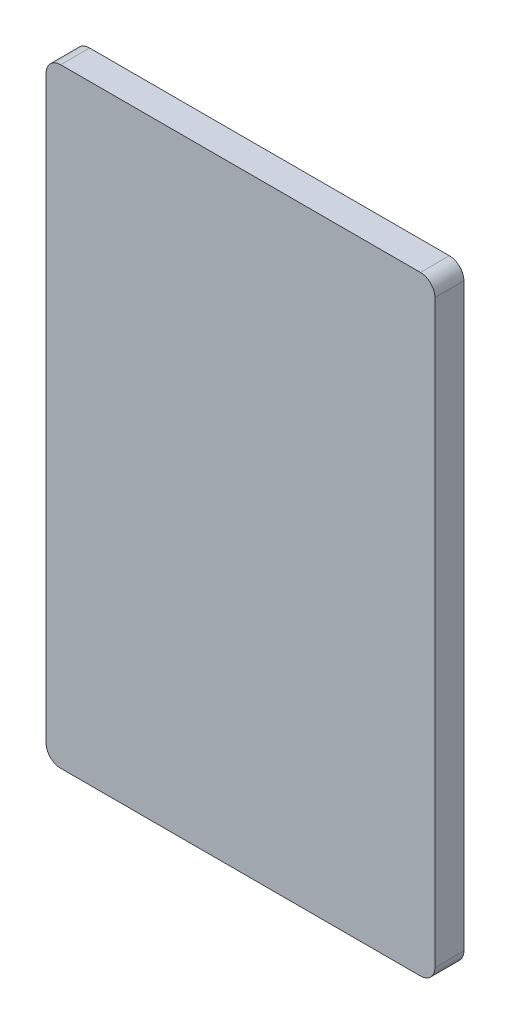
ISO-10303-21;
HEADER;
FILE_DESCRIPTION(('STEP AP214'),'2;1');
FILE_NAME('part.step','',(''),(''),'','','');
FILE_SCHEMA(('AUTOMOTIVE_DESIGN { 1 0 10303 214 1 1 1 1 }'));
ENDSEC;
DATA;
#1=APPLICATION_CONTEXT('core data for automotive mechanical design processes');
#2=APPLICATION_PROTOCOL_DEFINITION('international standard','automotive_design',2000,#1);
#3=PRODUCT_CONTEXT('',#1,'mechanical');
#4=PRODUCT('Part','Part','',(#3));
#5=PRODUCT_RELATED_PRODUCT_CATEGORY('part','',(#4));
#6=PRODUCT_DEFINITION_FORMATION('','',#4);
#7=PRODUCT_DEFINITION_CONTEXT('part definition',#1,'design');
#8=PRODUCT_DEFINITION('design','',#6,#7);
#9=PRODUCT_DEFINITION_SHAPE('','',#8);
#10=(LENGTH_UNIT() NAMED_UNIT(*) SI_UNIT(.MILLI.,.METRE.));
#11=(NAMED_UNIT(*) PLANE_ANGLE_UNIT() SI_UNIT($,.RADIAN.));
#12=(NAMED_UNIT(*) SI_UNIT($,.STERADIAN.) SOLID_ANGLE_UNIT());
#13=UNCERTAINTY_MEASURE_WITH_UNIT(LENGTH_MEASURE(1.E-05),#10,'distance_accuracy_value','');
#14=(GEOMETRIC_REPRESENTATION_CONTEXT(3) GLOBAL_UNCERTAINTY_ASSIGNED_CONTEXT((#13)) GLOBAL_UNIT_ASSIGNED_CONTEXT((#10,
#11,#12)) REPRESENTATION_CONTEXT('',''));
#15=CARTESIAN_POINT('',(0.,0.,0.));
#16=DIRECTION('',(0.,0.,1.));
#17=DIRECTION('',(1.,0.,0.));
#18=AXIS2_PLACEMENT_3D('',#15,#16,#17);
#19=CARTESIAN_POINT('',(2.5,2.5,5.));
#20=DIRECTION('',(0.,0.,-1.));
#21=DIRECTION('',(-1.,0.,0.));
#22=AXIS2_PLACEMENT_3D('',#19,#20,#21);
#23=CYLINDRICAL_SURFACE('',#22,2.5);
#24=CARTESIAN_POINT('',(2.5,2.5,0.));
#25=DIRECTION('',(0.,0.,1.));
#26=DIRECTION('',(1.,0.,0.));
#27=AXIS2_PLACEMENT_3D('',#24,#25,#26);
#28=CIRCLE('',#27,2.5);
#29=CARTESIAN_POINT('',(0.,2.50000000000002,0.));
#30=VERTEX_POINT('',#29);
#31=CARTESIAN_POINT('',(2.50000000000002,0.,0.));
#32=VERTEX_POINT('',#31);
#33=EDGE_CURVE('E129',#30,#32,#28,.T.);
#34=ORIENTED_EDGE('',*,*,#33,.T.);
#35=DIRECTION('',(0.,0.,-1.));
#36=VECTOR('',#35,1.);
#37=CARTESIAN_POINT('',(2.50000000000002,0.,5.));
#38=LINE('',#37,#36);
#39=CARTESIAN_POINT('',(2.50000000000002,0.,5.));
#40=VERTEX_POINT('',#39);
#41=EDGE_CURVE('E11',#40,#32,#38,.T.);
#42=ORIENTED_EDGE('',*,*,#41,.F.);
#43=CARTESIAN_POINT('',(2.5,2.5,5.));
#44=DIRECTION('',(0.,0.,1.));
#45=DIRECTION('',(1.,0.,0.));
#46=AXIS2_PLACEMENT_3D('',#43,#44,#45);
#47=CIRCLE('',#46,2.5);
#48=CARTESIAN_POINT('',(0.,2.50000000000002,5.));
#49=VERTEX_POINT('',#48);
#50=EDGE_CURVE('E143',#49,#40,#47,.T.);
#51=ORIENTED_EDGE('',*,*,#50,.F.);
#52=DIRECTION('',(0.,0.,-1.));
#53=VECTOR('',#52,1.);
#54=CARTESIAN_POINT('',(0.,2.50000000000002,5.));
#55=LINE('',#54,#53);
#56=EDGE_CURVE('E125',#49,#30,#55,.T.);
#57=ORIENTED_EDGE('',*,*,#56,.T.);
#58=EDGE_LOOP('',(#34,#42,#51,#57));
#59=FACE_BOUND('',#58,.T.);
#60=ADVANCED_FACE('F33',(#59),#23,.T.);
#61=CARTESIAN_POINT('',(2.50000000000002,0.,5.));
#62=DIRECTION('',(0.,1.,0.));
#63=DIRECTION('',(0.,0.,1.));
#64=AXIS2_PLACEMENT_3D('',#61,#62,#63);
#65=PLANE('',#64);
#66=DIRECTION('',(1.,0.,0.));
#67=VECTOR('',#66,1.);
#68=CARTESIAN_POINT('',(2.50000000000002,0.,0.));
#69=LINE('',#68,#67);
#70=CARTESIAN_POINT('',(64.6585838137056,0.,0.));
#71=VERTEX_POINT('',#70);
#72=EDGE_CURVE('E132',#32,#71,#69,.T.);
#73=ORIENTED_EDGE('',*,*,#72,.T.);
#74=DIRECTION('',(0.,0.,-1.));
#75=VECTOR('',#74,1.);
#76=CARTESIAN_POINT('',(64.6585838137056,0.,5.));
#77=LINE('',#76,#75);
#78=CARTESIAN_POINT('',(64.6585838137056,0.,5.));
#79=VERTEX_POINT('',#78);
#80=EDGE_CURVE('E41',#79,#71,#77,.T.);
#81=ORIENTED_EDGE('',*,*,#80,.F.);
#82=DIRECTION('',(1.,0.,0.));
#83=VECTOR('',#82,1.);
#84=CARTESIAN_POINT('',(2.50000000000002,0.,5.));
#85=LINE('',#84,#83);
#86=EDGE_CURVE('E92',#40,#79,#85,.T.);
#87=ORIENTED_EDGE('',*,*,#86,.F.);
#88=ORIENTED_EDGE('',*,*,#41,.T.);
#89=EDGE_LOOP('',(#73,#81,#87,#88));
#90=FACE_BOUND('',#89,.T.);
#91=ADVANCED_FACE('F178',(#90),#65,.F.);
#92=CARTESIAN_POINT('',(64.6585838137056,2.5,5.));
#93=DIRECTION('',(0.,0.,-1.));
#94=DIRECTION('',(-1.,0.,0.));
#95=AXIS2_PLACEMENT_3D('',#92,#93,#94);
#96=CYLINDRICAL_SURFACE('',#95,2.5);
#97=CARTESIAN_POINT('',(64.6585838137056,2.5,0.));
#98=DIRECTION('',(0.,0.,1.));
#99=DIRECTION('',(1.,0.,0.));
#100=AXIS2_PLACEMENT_3D('',#97,#98,#99);
#101=CIRCLE('',#100,2.5);
#102=CARTESIAN_POINT('',(67.1585838137056,2.50000000000002,0.));
#103=VERTEX_POINT('',#102);
#104=EDGE_CURVE('E134',#71,#103,#101,.T.);
#105=ORIENTED_EDGE('',*,*,#104,.T.);
#106=DIRECTION('',(0.,0.,-1.));
#107=VECTOR('',#106,1.);
#108=CARTESIAN_POINT('',(67.1585838137056,2.50000000000002,5.));
#109=LINE('',#108,#107);
#110=CARTESIAN_POINT('',(67.1585838137056,2.50000000000002,5.));
#111=VERTEX_POINT('',#110);
#112=EDGE_CURVE('E150',#111,#103,#109,.T.);
#113=ORIENTED_EDGE('',*,*,#112,.F.);
#114=CARTESIAN_POINT('',(64.6585838137056,2.5,5.));
#115=DIRECTION('',(0.,0.,1.));
#116=DIRECTION('',(1.,0.,0.));
#117=AXIS2_PLACEMENT_3D('',#114,#115,#116);
#118=CIRCLE('',#117,2.5);
#119=EDGE_CURVE('E158',#79,#111,#118,.T.);
#120=ORIENTED_EDGE('',*,*,#119,.F.);
#121=ORIENTED_EDGE('',*,*,#80,.T.);
#122=EDGE_LOOP('',(#105,#113,#120,#121));
#123=FACE_BOUND('',#122,.T.);
#124=ADVANCED_FACE('F156',(#123),#96,.T.);
#125=CARTESIAN_POINT('',(67.1585838137056,2.50000000000002,5.));
#126=DIRECTION('',(-1.,0.,0.));
#127=DIRECTION('',(0.,0.,1.));
#128=AXIS2_PLACEMENT_3D('',#125,#126,#127);
#129=PLANE('',#128);
#130=DIRECTION('',(0.,1.,0.));
#131=VECTOR('',#130,1.);
#132=CARTESIAN_POINT('',(67.1585838137056,2.50000000000002,0.));
#133=LINE('',#132,#131);
#134=CARTESIAN_POINT('',(67.1585838137056,102.7498,0.));
#135=VERTEX_POINT('',#134);
#136=EDGE_CURVE('E136',#103,#135,#133,.T.);
#137=ORIENTED_EDGE('',*,*,#136,.T.);
#138=DIRECTION('',(0.,0.,-1.));
#139=VECTOR('',#138,1.);
#140=CARTESIAN_POINT('',(67.1585838137056,102.7498,5.));
#141=LINE('',#140,#139);
#142=CARTESIAN_POINT('',(67.1585838137056,102.7498,5.));
#143=VERTEX_POINT('',#142);
#144=EDGE_CURVE('E147',#143,#135,#141,.T.);
#145=ORIENTED_EDGE('',*,*,#144,.F.);
#146=DIRECTION('',(0.,1.,0.));
#147=VECTOR('',#146,1.);
#148=CARTESIAN_POINT('',(67.1585838137056,2.50000000000002,5.));
#149=LINE('',#148,#147);
#150=EDGE_CURVE('E170',#111,#143,#149,.T.);
#151=ORIENTED_EDGE('',*,*,#150,.F.);
#152=ORIENTED_EDGE('',*,*,#112,.T.);
#153=EDGE_LOOP('',(#137,#145,#151,#152));
#154=FACE_BOUND('',#153,.T.);
#155=ADVANCED_FACE('F166',(#154),#129,.F.);
#156=CARTESIAN_POINT('',(64.6585838137056,102.7498,5.));
#157=DIRECTION('',(0.,0.,-1.));
#158=DIRECTION('',(-1.,0.,0.));
#159=AXIS2_PLACEMENT_3D('',#156,#157,#158);
#160=CYLINDRICAL_SURFACE('',#159,2.5);
#161=CARTESIAN_POINT('',(64.6585838137056,102.7498,0.));
#162=DIRECTION('',(0.,0.,1.));
#163=DIRECTION('',(1.,0.,0.));
#164=AXIS2_PLACEMENT_3D('',#161,#162,#163);
#165=CIRCLE('',#164,2.5);
#166=CARTESIAN_POINT('',(64.6585838137056,105.2498,0.));
#167=VERTEX_POINT('',#166);
#168=EDGE_CURVE('E138',#135,#167,#165,.T.);
#169=ORIENTED_EDGE('',*,*,#168,.T.);
#170=DIRECTION('',(0.,0.,-1.));
#171=VECTOR('',#170,1.);
#172=CARTESIAN_POINT('',(64.6585838137056,105.2498,5.));
#173=LINE('',#172,#171);
#174=CARTESIAN_POINT('',(64.6585838137056,105.2498,5.));
#175=VERTEX_POINT('',#174);
#176=EDGE_CURVE('E120',#175,#167,#173,.T.);
#177=ORIENTED_EDGE('',*,*,#176,.F.);
#178=CARTESIAN_POINT('',(64.6585838137056,102.7498,5.));
#179=DIRECTION('',(0.,0.,1.));
#180=DIRECTION('',(1.,0.,0.));
#181=AXIS2_PLACEMENT_3D('',#178,#179,#180);
#182=CIRCLE('',#181,2.5);
#183=EDGE_CURVE('E111',#143,#175,#182,.T.);
#184=ORIENTED_EDGE('',*,*,#183,.F.);
#185=ORIENTED_EDGE('',*,*,#144,.T.);
#186=EDGE_LOOP('',(#169,#177,#184,#185));
#187=FACE_BOUND('',#186,.T.);
#188=ADVANCED_FACE('F169',(#187),#160,.T.);
#189=CARTESIAN_POINT('',(2.50000000000002,105.2498,5.));
#190=DIRECTION('',(0.,-1.,0.));
#191=DIRECTION('',(0.,0.,-1.));
#192=AXIS2_PLACEMENT_3D('',#189,#190,#191);
#193=PLANE('',#192);
#194=DIRECTION('',(-1.,0.,0.));
#195=VECTOR('',#194,1.);
#196=CARTESIAN_POINT('',(2.50000000000002,105.2498,0.));
#197=LINE('',#196,#195);
#198=CARTESIAN_POINT('',(2.50000000000002,105.2498,0.));
#199=VERTEX_POINT('',#198);
#200=EDGE_CURVE('E119',#167,#199,#197,.T.);
#201=ORIENTED_EDGE('',*,*,#200,.T.);
#202=DIRECTION('',(0.,0.,-1.));
#203=VECTOR('',#202,1.);
#204=CARTESIAN_POINT('',(2.50000000000002,105.2498,5.));
#205=LINE('',#204,#203);
#206=CARTESIAN_POINT('',(2.50000000000002,105.2498,5.));
#207=VERTEX_POINT('',#206);
#208=EDGE_CURVE('E116',#207,#199,#205,.T.);
#209=ORIENTED_EDGE('',*,*,#208,.F.);
#210=DIRECTION('',(-1.,0.,0.));
#211=VECTOR('',#210,1.);
#212=CARTESIAN_POINT('',(2.50000000000002,105.2498,5.));
#213=LINE('',#212,#211);
#214=EDGE_CURVE('E105',#175,#207,#213,.T.);
#215=ORIENTED_EDGE('',*,*,#214,.F.);
#216=ORIENTED_EDGE('',*,*,#176,.T.);
#217=EDGE_LOOP('',(#201,#209,#215,#216));
#218=FACE_BOUND('',#217,.T.);
#219=ADVANCED_FACE('F117',(#218),#193,.F.);
#220=CARTESIAN_POINT('',(2.5,102.7498,5.));
#221=DIRECTION('',(0.,0.,-1.));
#222=DIRECTION('',(-1.,0.,0.));
#223=AXIS2_PLACEMENT_3D('',#220,#221,#222);
#224=CYLINDRICAL_SURFACE('',#223,2.5);
#225=CARTESIAN_POINT('',(2.5,102.7498,0.));
#226=DIRECTION('',(0.,0.,1.));
#227=DIRECTION('',(1.,0.,0.));
#228=AXIS2_PLACEMENT_3D('',#225,#226,#227);
#229=CIRCLE('',#228,2.5);
#230=CARTESIAN_POINT('',(0.,102.7498,0.));
#231=VERTEX_POINT('',#230);
#232=EDGE_CURVE('E78',#199,#231,#229,.T.);
#233=ORIENTED_EDGE('',*,*,#232,.T.);
#234=DIRECTION('',(0.,0.,-1.));
#235=VECTOR('',#234,1.);
#236=CARTESIAN_POINT('',(0.,102.7498,5.));
#237=LINE('',#236,#235);
#238=CARTESIAN_POINT('',(0.,102.7498,5.));
#239=VERTEX_POINT('',#238);
#240=EDGE_CURVE('E121',#239,#231,#237,.T.);
#241=ORIENTED_EDGE('',*,*,#240,.F.);
#242=CARTESIAN_POINT('',(2.5,102.7498,5.));
#243=DIRECTION('',(0.,0.,1.));
#244=DIRECTION('',(1.,0.,0.));
#245=AXIS2_PLACEMENT_3D('',#242,#243,#244);
#246=CIRCLE('',#245,2.5);
#247=EDGE_CURVE('E109',#207,#239,#246,.T.);
#248=ORIENTED_EDGE('',*,*,#247,.F.);
#249=ORIENTED_EDGE('',*,*,#208,.T.);
#250=EDGE_LOOP('',(#233,#241,#248,#249));
#251=FACE_BOUND('',#250,.T.);
#252=ADVANCED_FACE('F123',(#251),#224,.T.);
#253=CARTESIAN_POINT('',(0.,2.50000000000002,5.));
#254=DIRECTION('',(1.,0.,0.));
#255=DIRECTION('',(0.,0.,-1.));
#256=AXIS2_PLACEMENT_3D('',#253,#254,#255);
#257=PLANE('',#256);
#258=DIRECTION('',(0.,-1.,0.));
#259=VECTOR('',#258,1.);
#260=CARTESIAN_POINT('',(0.,2.50000000000002,0.));
#261=LINE('',#260,#259);
#262=EDGE_CURVE('E84',#231,#30,#261,.T.);
#263=ORIENTED_EDGE('',*,*,#262,.T.);
#264=ORIENTED_EDGE('',*,*,#56,.F.);
#265=DIRECTION('',(0.,-1.,0.));
#266=VECTOR('',#265,1.);
#267=CARTESIAN_POINT('',(0.,2.50000000000002,5.));
#268=LINE('',#267,#266);
#269=EDGE_CURVE('E49',#239,#49,#268,.T.);
#270=ORIENTED_EDGE('',*,*,#269,.F.);
#271=ORIENTED_EDGE('',*,*,#240,.T.);
#272=EDGE_LOOP('',(#263,#264,#270,#271));
#273=FACE_BOUND('',#272,.T.);
#274=ADVANCED_FACE('F194',(#273),#257,.F.);
#275=CARTESIAN_POINT('',(2.5,2.5,5.));
#276=DIRECTION('',(0.,0.,1.));
#277=DIRECTION('',(1.,0.,0.));
#278=AXIS2_PLACEMENT_3D('',#275,#276,#277);
#279=PLANE('',#278);
#280=ORIENTED_EDGE('',*,*,#50,.T.);
#281=ORIENTED_EDGE('',*,*,#86,.T.);
#282=ORIENTED_EDGE('',*,*,#119,.T.);
#283=ORIENTED_EDGE('',*,*,#150,.T.);
#284=ORIENTED_EDGE('',*,*,#183,.T.);
#285=ORIENTED_EDGE('',*,*,#214,.T.);
#286=ORIENTED_EDGE('',*,*,#247,.T.);
#287=ORIENTED_EDGE('',*,*,#269,.T.);
#288=EDGE_LOOP('',(#280,#281,#282,#283,#284,#285,#286,#287));
#289=FACE_BOUND('',#288,.T.);
#290=ADVANCED_FACE('F107',(#289),#279,.T.);
#291=CARTESIAN_POINT('',(2.5,2.5,0.));
#292=DIRECTION('',(0.,0.,1.));
#293=DIRECTION('',(1.,0.,0.));
#294=AXIS2_PLACEMENT_3D('',#291,#292,#293);
#295=PLANE('',#294);
#296=ORIENTED_EDGE('',*,*,#33,.F.);
#297=ORIENTED_EDGE('',*,*,#262,.F.);
#298=ORIENTED_EDGE('',*,*,#232,.F.);
#299=ORIENTED_EDGE('',*,*,#200,.F.);
#300=ORIENTED_EDGE('',*,*,#168,.F.);
#301=ORIENTED_EDGE('',*,*,#136,.F.);
#302=ORIENTED_EDGE('',*,*,#104,.F.);
#303=ORIENTED_EDGE('',*,*,#72,.F.);
#304=EDGE_LOOP('',(#296,#297,#298,#299,#300,#301,#302,#303));
#305=FACE_BOUND('',#304,.T.);
#306=ADVANCED_FACE('F162',(#305),#295,.F.);
#307=CLOSED_SHELL('',(#60,#91,#124,#155,#188,#219,#252,#274,#290,#306));
#308=MANIFOLD_SOLID_BREP('B2',#307);
#309=ADVANCED_BREP_SHAPE_REPRESENTATION('',(#18,#308),#14);
#310=SHAPE_DEFINITION_REPRESENTATION(#9,#309);
ENDSEC;
END-ISO-10303-21;
